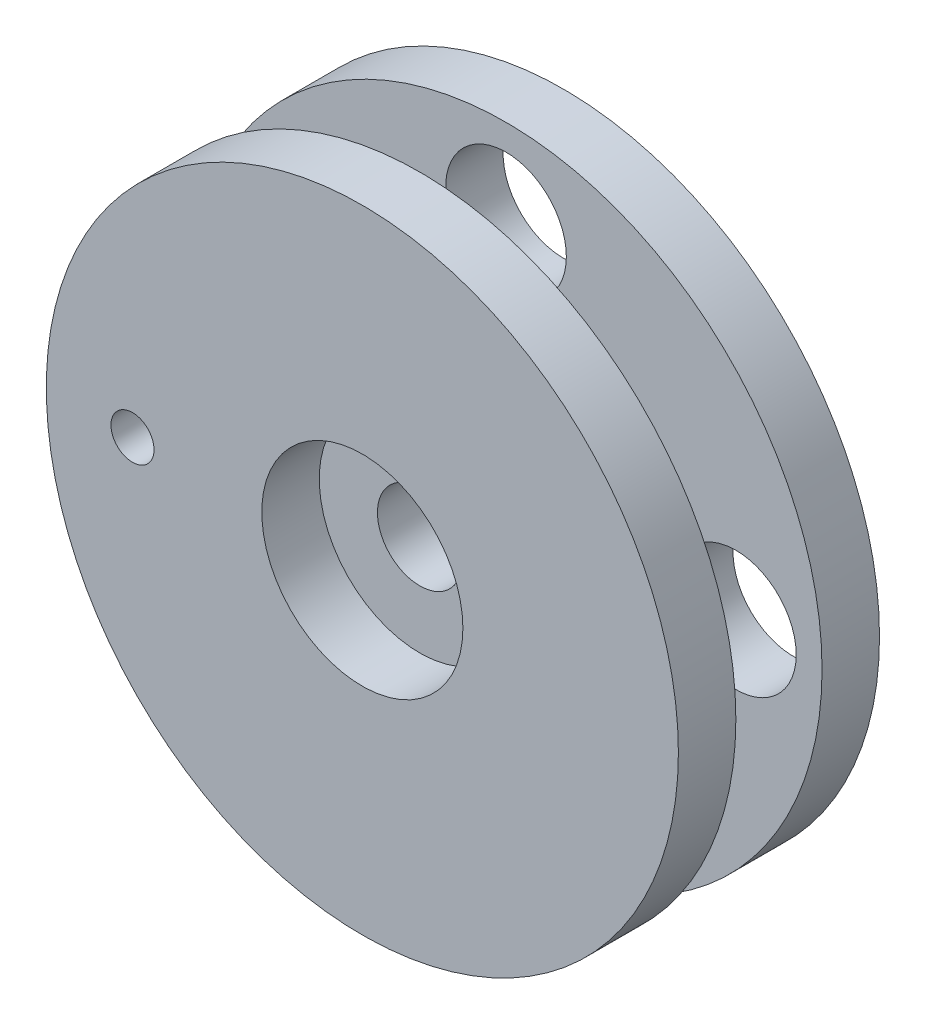
ISO-10303-21;
HEADER;
FILE_DESCRIPTION(('STEP AP214'),'2;1');
FILE_NAME('part.step','',(''),(''),'','','');
FILE_SCHEMA(('AUTOMOTIVE_DESIGN { 1 0 10303 214 1 1 1 1 }'));
ENDSEC;
DATA;
#1=APPLICATION_CONTEXT('core data for automotive mechanical design processes');
#2=APPLICATION_PROTOCOL_DEFINITION('international standard','automotive_design',2000,#1);
#3=PRODUCT_CONTEXT('',#1,'mechanical');
#4=PRODUCT('Part','Part','',(#3));
#5=PRODUCT_RELATED_PRODUCT_CATEGORY('part','',(#4));
#6=PRODUCT_DEFINITION_FORMATION('','',#4);
#7=PRODUCT_DEFINITION_CONTEXT('part definition',#1,'design');
#8=PRODUCT_DEFINITION('design','',#6,#7);
#9=PRODUCT_DEFINITION_SHAPE('','',#8);
#10=(LENGTH_UNIT() NAMED_UNIT(*) SI_UNIT(.MILLI.,.METRE.));
#11=(NAMED_UNIT(*) PLANE_ANGLE_UNIT() SI_UNIT($,.RADIAN.));
#12=(NAMED_UNIT(*) SI_UNIT($,.STERADIAN.) SOLID_ANGLE_UNIT());
#13=UNCERTAINTY_MEASURE_WITH_UNIT(LENGTH_MEASURE(1.E-05),#10,'distance_accuracy_value','');
#14=(GEOMETRIC_REPRESENTATION_CONTEXT(3) GLOBAL_UNCERTAINTY_ASSIGNED_CONTEXT((#13)) GLOBAL_UNIT_ASSIGNED_CONTEXT((#10,
#11,#12)) REPRESENTATION_CONTEXT('',''));
#15=CARTESIAN_POINT('',(0.,0.,0.));
#16=DIRECTION('',(0.,0.,1.));
#17=DIRECTION('',(1.,0.,0.));
#18=AXIS2_PLACEMENT_3D('',#15,#16,#17);
#19=CARTESIAN_POINT('',(0.,0.,2.));
#20=DIRECTION('',(0.,0.,1.));
#21=DIRECTION('',(1.,0.,0.));
#22=AXIS2_PLACEMENT_3D('',#19,#20,#21);
#23=PLANE('',#22);
#24=CARTESIAN_POINT('',(0.,-8.,2.));
#25=DIRECTION('',(0.,0.,1.));
#26=DIRECTION('',(1.,0.,0.));
#27=AXIS2_PLACEMENT_3D('',#24,#25,#26);
#28=CIRCLE('',#27,2.1);
#29=CARTESIAN_POINT('',(2.1,-8.,2.));
#30=VERTEX_POINT('',#29);
#31=EDGE_CURVE('E66',#30,#30,#28,.T.);
#32=ORIENTED_EDGE('',*,*,#31,.F.);
#33=EDGE_LOOP('',(#32));
#34=FACE_BOUND('',#33,.T.);
#35=CARTESIAN_POINT('',(0.,8.,2.));
#36=DIRECTION('',(0.,0.,1.));
#37=DIRECTION('',(1.,0.,0.));
#38=AXIS2_PLACEMENT_3D('',#35,#36,#37);
#39=CIRCLE('',#38,2.1);
#40=CARTESIAN_POINT('',(2.1,8.,2.));
#41=VERTEX_POINT('',#40);
#42=EDGE_CURVE('E54',#41,#41,#39,.T.);
#43=ORIENTED_EDGE('',*,*,#42,.F.);
#44=EDGE_LOOP('',(#43));
#45=FACE_BOUND('',#44,.T.);
#46=CARTESIAN_POINT('',(0.,0.,2.));
#47=DIRECTION('',(0.,0.,1.));
#48=DIRECTION('',(1.,0.,0.));
#49=AXIS2_PLACEMENT_3D('',#46,#47,#48);
#50=CIRCLE('',#49,11.);
#51=CARTESIAN_POINT('',(11.,0.,2.));
#52=VERTEX_POINT('',#51);
#53=EDGE_CURVE('E37',#52,#52,#50,.T.);
#54=ORIENTED_EDGE('',*,*,#53,.T.);
#55=EDGE_LOOP('',(#54));
#56=FACE_BOUND('',#55,.T.);
#57=CARTESIAN_POINT('',(-8.,0.,2.));
#58=DIRECTION('',(0.,0.,1.));
#59=DIRECTION('',(1.,0.,0.));
#60=AXIS2_PLACEMENT_3D('',#57,#58,#59);
#61=CIRCLE('',#60,2.1);
#62=CARTESIAN_POINT('',(-5.9,0.,2.));
#63=VERTEX_POINT('',#62);
#64=EDGE_CURVE('E50',#63,#63,#61,.T.);
#65=ORIENTED_EDGE('',*,*,#64,.F.);
#66=EDGE_LOOP('',(#65));
#67=FACE_BOUND('',#66,.T.);
#68=CARTESIAN_POINT('',(8.,0.,2.));
#69=DIRECTION('',(0.,0.,1.));
#70=DIRECTION('',(1.,0.,0.));
#71=AXIS2_PLACEMENT_3D('',#68,#69,#70);
#72=CIRCLE('',#71,2.1);
#73=CARTESIAN_POINT('',(10.1,0.,2.));
#74=VERTEX_POINT('',#73);
#75=EDGE_CURVE('E60',#74,#74,#72,.T.);
#76=ORIENTED_EDGE('',*,*,#75,.F.);
#77=EDGE_LOOP('',(#76));
#78=FACE_BOUND('',#77,.T.);
#79=CARTESIAN_POINT('',(0.,0.,2.));
#80=DIRECTION('',(0.,0.,1.));
#81=DIRECTION('',(1.,0.,0.));
#82=AXIS2_PLACEMENT_3D('',#79,#80,#81);
#83=CIRCLE('',#82,5.);
#84=CARTESIAN_POINT('',(5.,0.,2.));
#85=VERTEX_POINT('',#84);
#86=EDGE_CURVE('E75',#85,#85,#83,.T.);
#87=ORIENTED_EDGE('',*,*,#86,.F.);
#88=EDGE_LOOP('',(#87));
#89=FACE_BOUND('',#88,.T.);
#90=ADVANCED_FACE('F30',(#34,#45,#56,#67,#78,#89),#23,.T.);
#91=CARTESIAN_POINT('',(0.,0.,0.));
#92=DIRECTION('',(0.,0.,1.));
#93=DIRECTION('',(1.,0.,0.));
#94=AXIS2_PLACEMENT_3D('',#91,#92,#93);
#95=PLANE('',#94);
#96=CARTESIAN_POINT('',(8.,0.,0.));
#97=DIRECTION('',(0.,0.,1.));
#98=DIRECTION('',(1.,0.,0.));
#99=AXIS2_PLACEMENT_3D('',#96,#97,#98);
#100=CIRCLE('',#99,2.1);
#101=CARTESIAN_POINT('',(10.1,0.,0.));
#102=VERTEX_POINT('',#101);
#103=EDGE_CURVE('E63',#102,#102,#100,.T.);
#104=ORIENTED_EDGE('',*,*,#103,.T.);
#105=EDGE_LOOP('',(#104));
#106=FACE_BOUND('',#105,.T.);
#107=CARTESIAN_POINT('',(-8.,0.,0.));
#108=DIRECTION('',(0.,0.,1.));
#109=DIRECTION('',(1.,0.,0.));
#110=AXIS2_PLACEMENT_3D('',#107,#108,#109);
#111=CIRCLE('',#110,2.1);
#112=CARTESIAN_POINT('',(-5.9,0.,0.));
#113=VERTEX_POINT('',#112);
#114=EDGE_CURVE('E51',#113,#113,#111,.T.);
#115=ORIENTED_EDGE('',*,*,#114,.T.);
#116=EDGE_LOOP('',(#115));
#117=FACE_BOUND('',#116,.T.);
#118=CARTESIAN_POINT('',(0.,0.,0.));
#119=DIRECTION('',(0.,0.,1.));
#120=DIRECTION('',(1.,0.,0.));
#121=AXIS2_PLACEMENT_3D('',#118,#119,#120);
#122=CIRCLE('',#121,11.);
#123=CARTESIAN_POINT('',(11.,0.,0.));
#124=VERTEX_POINT('',#123);
#125=EDGE_CURVE('E41',#124,#124,#122,.T.);
#126=ORIENTED_EDGE('',*,*,#125,.F.);
#127=EDGE_LOOP('',(#126));
#128=FACE_BOUND('',#127,.T.);
#129=CARTESIAN_POINT('',(0.,0.,0.));
#130=DIRECTION('',(0.,0.,1.));
#131=DIRECTION('',(1.,0.,0.));
#132=AXIS2_PLACEMENT_3D('',#129,#130,#131);
#133=CIRCLE('',#132,1.475);
#134=CARTESIAN_POINT('',(1.475,0.,0.));
#135=VERTEX_POINT('',#134);
#136=EDGE_CURVE('E46',#135,#135,#133,.T.);
#137=ORIENTED_EDGE('',*,*,#136,.T.);
#138=EDGE_LOOP('',(#137));
#139=FACE_BOUND('',#138,.T.);
#140=CARTESIAN_POINT('',(0.,8.,0.));
#141=DIRECTION('',(0.,0.,1.));
#142=DIRECTION('',(1.,0.,0.));
#143=AXIS2_PLACEMENT_3D('',#140,#141,#142);
#144=CIRCLE('',#143,2.1);
#145=CARTESIAN_POINT('',(2.1,8.,0.));
#146=VERTEX_POINT('',#145);
#147=EDGE_CURVE('E57',#146,#146,#144,.T.);
#148=ORIENTED_EDGE('',*,*,#147,.T.);
#149=EDGE_LOOP('',(#148));
#150=FACE_BOUND('',#149,.T.);
#151=CARTESIAN_POINT('',(0.,-8.,0.));
#152=DIRECTION('',(0.,0.,1.));
#153=DIRECTION('',(1.,0.,0.));
#154=AXIS2_PLACEMENT_3D('',#151,#152,#153);
#155=CIRCLE('',#154,2.1);
#156=CARTESIAN_POINT('',(2.1,-8.,0.));
#157=VERTEX_POINT('',#156);
#158=EDGE_CURVE('E69',#157,#157,#155,.T.);
#159=ORIENTED_EDGE('',*,*,#158,.T.);
#160=EDGE_LOOP('',(#159));
#161=FACE_BOUND('',#160,.T.);
#162=ADVANCED_FACE('F122',(#106,#117,#128,#139,#150,#161),#95,.F.);
#163=CARTESIAN_POINT('',(0.,0.,2.));
#164=DIRECTION('',(0.,0.,-1.));
#165=DIRECTION('',(-1.,0.,0.));
#166=AXIS2_PLACEMENT_3D('',#163,#164,#165);
#167=CYLINDRICAL_SURFACE('',#166,11.);
#168=ORIENTED_EDGE('',*,*,#53,.F.);
#169=EDGE_LOOP('',(#168));
#170=FACE_BOUND('',#169,.T.);
#171=ORIENTED_EDGE('',*,*,#125,.T.);
#172=EDGE_LOOP('',(#171));
#173=FACE_BOUND('',#172,.T.);
#174=ADVANCED_FACE('F32',(#170,#173),#167,.T.);
#175=CARTESIAN_POINT('',(0.,0.,2.));
#176=DIRECTION('',(0.,0.,-1.));
#177=DIRECTION('',(-1.,0.,0.));
#178=AXIS2_PLACEMENT_3D('',#175,#176,#177);
#179=CYLINDRICAL_SURFACE('',#178,1.475);
#180=ORIENTED_EDGE('',*,*,#136,.F.);
#181=EDGE_LOOP('',(#180));
#182=FACE_BOUND('',#181,.T.);
#183=CARTESIAN_POINT('',(0.,0.,5.));
#184=DIRECTION('',(0.,0.,1.));
#185=DIRECTION('',(1.,0.,0.));
#186=AXIS2_PLACEMENT_3D('',#183,#184,#185);
#187=CIRCLE('',#186,1.475);
#188=CARTESIAN_POINT('',(1.475,0.,5.));
#189=VERTEX_POINT('',#188);
#190=EDGE_CURVE('E78',#189,#189,#187,.T.);
#191=ORIENTED_EDGE('',*,*,#190,.T.);
#192=EDGE_LOOP('',(#191));
#193=FACE_BOUND('',#192,.T.);
#194=ADVANCED_FACE('F132',(#182,#193),#179,.F.);
#195=CARTESIAN_POINT('',(-8.,0.,2.));
#196=DIRECTION('',(0.,0.,-1.));
#197=DIRECTION('',(-1.,0.,0.));
#198=AXIS2_PLACEMENT_3D('',#195,#196,#197);
#199=CYLINDRICAL_SURFACE('',#198,2.1);
#200=ORIENTED_EDGE('',*,*,#64,.T.);
#201=EDGE_LOOP('',(#200));
#202=FACE_BOUND('',#201,.T.);
#203=ORIENTED_EDGE('',*,*,#114,.F.);
#204=EDGE_LOOP('',(#203));
#205=FACE_BOUND('',#204,.T.);
#206=ADVANCED_FACE('F135',(#202,#205),#199,.F.);
#207=CARTESIAN_POINT('',(0.,8.,2.));
#208=DIRECTION('',(0.,0.,-1.));
#209=DIRECTION('',(-1.,0.,0.));
#210=AXIS2_PLACEMENT_3D('',#207,#208,#209);
#211=CYLINDRICAL_SURFACE('',#210,2.1);
#212=ORIENTED_EDGE('',*,*,#42,.T.);
#213=EDGE_LOOP('',(#212));
#214=FACE_BOUND('',#213,.T.);
#215=ORIENTED_EDGE('',*,*,#147,.F.);
#216=EDGE_LOOP('',(#215));
#217=FACE_BOUND('',#216,.T.);
#218=ADVANCED_FACE('F139',(#214,#217),#211,.F.);
#219=CARTESIAN_POINT('',(8.,0.,2.));
#220=DIRECTION('',(0.,0.,-1.));
#221=DIRECTION('',(-1.,0.,0.));
#222=AXIS2_PLACEMENT_3D('',#219,#220,#221);
#223=CYLINDRICAL_SURFACE('',#222,2.1);
#224=ORIENTED_EDGE('',*,*,#75,.T.);
#225=EDGE_LOOP('',(#224));
#226=FACE_BOUND('',#225,.T.);
#227=ORIENTED_EDGE('',*,*,#103,.F.);
#228=EDGE_LOOP('',(#227));
#229=FACE_BOUND('',#228,.T.);
#230=ADVANCED_FACE('F143',(#226,#229),#223,.F.);
#231=CARTESIAN_POINT('',(0.,-8.,2.));
#232=DIRECTION('',(0.,0.,-1.));
#233=DIRECTION('',(-1.,0.,0.));
#234=AXIS2_PLACEMENT_3D('',#231,#232,#233);
#235=CYLINDRICAL_SURFACE('',#234,2.1);
#236=ORIENTED_EDGE('',*,*,#31,.T.);
#237=EDGE_LOOP('',(#236));
#238=FACE_BOUND('',#237,.T.);
#239=ORIENTED_EDGE('',*,*,#158,.F.);
#240=EDGE_LOOP('',(#239));
#241=FACE_BOUND('',#240,.T.);
#242=ADVANCED_FACE('F147',(#238,#241),#235,.F.);
#243=CARTESIAN_POINT('',(0.,0.,5.));
#244=DIRECTION('',(0.,0.,1.));
#245=DIRECTION('',(1.,0.,0.));
#246=AXIS2_PLACEMENT_3D('',#243,#244,#245);
#247=PLANE('',#246);
#248=CARTESIAN_POINT('',(0.,0.,5.));
#249=DIRECTION('',(0.,0.,1.));
#250=DIRECTION('',(1.,0.,0.));
#251=AXIS2_PLACEMENT_3D('',#248,#249,#250);
#252=CIRCLE('',#251,3.5);
#253=CARTESIAN_POINT('',(3.5,0.,5.));
#254=VERTEX_POINT('',#253);
#255=EDGE_CURVE('E10',#254,#254,#252,.F.);
#256=ORIENTED_EDGE('',*,*,#255,.F.);
#257=EDGE_LOOP('',(#256));
#258=FACE_BOUND('',#257,.T.);
#259=ORIENTED_EDGE('',*,*,#190,.F.);
#260=EDGE_LOOP('',(#259));
#261=FACE_BOUND('',#260,.T.);
#262=ADVANCED_FACE('F151',(#258,#261),#247,.T.);
#263=CARTESIAN_POINT('',(0.,0.,5.));
#264=DIRECTION('',(0.,0.,-1.));
#265=DIRECTION('',(-1.,0.,0.));
#266=AXIS2_PLACEMENT_3D('',#263,#264,#265);
#267=CYLINDRICAL_SURFACE('',#266,5.);
#268=CARTESIAN_POINT('',(0.,0.,5.));
#269=DIRECTION('',(0.,0.,1.));
#270=DIRECTION('',(1.,0.,0.));
#271=AXIS2_PLACEMENT_3D('',#268,#269,#270);
#272=CIRCLE('',#271,5.);
#273=CARTESIAN_POINT('',(5.,0.,5.));
#274=VERTEX_POINT('',#273);
#275=EDGE_CURVE('E72',#274,#274,#272,.T.);
#276=ORIENTED_EDGE('',*,*,#275,.F.);
#277=EDGE_LOOP('',(#276));
#278=FACE_BOUND('',#277,.T.);
#279=ORIENTED_EDGE('',*,*,#86,.T.);
#280=EDGE_LOOP('',(#279));
#281=FACE_BOUND('',#280,.T.);
#282=ADVANCED_FACE('F115',(#278,#281),#267,.T.);
#283=CARTESIAN_POINT('',(0.,0.,5.));
#284=DIRECTION('',(0.,0.,1.));
#285=DIRECTION('',(1.,0.,0.));
#286=AXIS2_PLACEMENT_3D('',#283,#284,#285);
#287=PLANE('',#286);
#288=CARTESIAN_POINT('',(-8.,0.,5.));
#289=DIRECTION('',(0.,0.,1.));
#290=DIRECTION('',(1.,0.,0.));
#291=AXIS2_PLACEMENT_3D('',#288,#289,#290);
#292=CIRCLE('',#291,0.75);
#293=CARTESIAN_POINT('',(-7.25,0.,5.));
#294=VERTEX_POINT('',#293);
#295=EDGE_CURVE('E93',#294,#294,#292,.T.);
#296=ORIENTED_EDGE('',*,*,#295,.T.);
#297=EDGE_LOOP('',(#296));
#298=FACE_BOUND('',#297,.T.);
#299=CARTESIAN_POINT('',(0.,0.,5.));
#300=DIRECTION('',(0.,0.,1.));
#301=DIRECTION('',(1.,0.,0.));
#302=AXIS2_PLACEMENT_3D('',#299,#300,#301);
#303=CIRCLE('',#302,11.);
#304=CARTESIAN_POINT('',(11.,0.,5.));
#305=VERTEX_POINT('',#304);
#306=EDGE_CURVE('E84',#305,#305,#303,.T.);
#307=ORIENTED_EDGE('',*,*,#306,.F.);
#308=EDGE_LOOP('',(#307));
#309=FACE_BOUND('',#308,.T.);
#310=ORIENTED_EDGE('',*,*,#275,.T.);
#311=EDGE_LOOP('',(#310));
#312=FACE_BOUND('',#311,.T.);
#313=ADVANCED_FACE('F105',(#298,#309,#312),#287,.F.);
#314=CARTESIAN_POINT('',(0.,0.,7.));
#315=DIRECTION('',(0.,0.,1.));
#316=DIRECTION('',(1.,0.,0.));
#317=AXIS2_PLACEMENT_3D('',#314,#315,#316);
#318=PLANE('',#317);
#319=CARTESIAN_POINT('',(0.,0.,7.));
#320=DIRECTION('',(0.,0.,1.));
#321=DIRECTION('',(1.,0.,0.));
#322=AXIS2_PLACEMENT_3D('',#319,#320,#321);
#323=CIRCLE('',#322,3.5);
#324=CARTESIAN_POINT('',(3.5,0.,7.));
#325=VERTEX_POINT('',#324);
#326=EDGE_CURVE('E87',#325,#325,#323,.T.);
#327=ORIENTED_EDGE('',*,*,#326,.F.);
#328=EDGE_LOOP('',(#327));
#329=FACE_BOUND('',#328,.T.);
#330=CARTESIAN_POINT('',(0.,0.,7.));
#331=DIRECTION('',(0.,0.,1.));
#332=DIRECTION('',(1.,0.,0.));
#333=AXIS2_PLACEMENT_3D('',#330,#331,#332);
#334=CIRCLE('',#333,11.);
#335=CARTESIAN_POINT('',(11.,0.,7.));
#336=VERTEX_POINT('',#335);
#337=EDGE_CURVE('E83',#336,#336,#334,.T.);
#338=ORIENTED_EDGE('',*,*,#337,.T.);
#339=EDGE_LOOP('',(#338));
#340=FACE_BOUND('',#339,.T.);
#341=CARTESIAN_POINT('',(-8.,0.,7.));
#342=DIRECTION('',(0.,0.,1.));
#343=DIRECTION('',(1.,0.,0.));
#344=AXIS2_PLACEMENT_3D('',#341,#342,#343);
#345=CIRCLE('',#344,0.75);
#346=CARTESIAN_POINT('',(-7.25,0.,7.));
#347=VERTEX_POINT('',#346);
#348=EDGE_CURVE('E92',#347,#347,#345,.T.);
#349=ORIENTED_EDGE('',*,*,#348,.F.);
#350=EDGE_LOOP('',(#349));
#351=FACE_BOUND('',#350,.T.);
#352=ADVANCED_FACE('F102',(#329,#340,#351),#318,.T.);
#353=CARTESIAN_POINT('',(0.,0.,7.));
#354=DIRECTION('',(0.,0.,-1.));
#355=DIRECTION('',(-1.,0.,0.));
#356=AXIS2_PLACEMENT_3D('',#353,#354,#355);
#357=CYLINDRICAL_SURFACE('',#356,11.);
#358=ORIENTED_EDGE('',*,*,#337,.F.);
#359=EDGE_LOOP('',(#358));
#360=FACE_BOUND('',#359,.T.);
#361=ORIENTED_EDGE('',*,*,#306,.T.);
#362=EDGE_LOOP('',(#361));
#363=FACE_BOUND('',#362,.T.);
#364=ADVANCED_FACE('F104',(#360,#363),#357,.T.);
#365=CARTESIAN_POINT('',(0.,0.,7.));
#366=DIRECTION('',(0.,0.,-1.));
#367=DIRECTION('',(-1.,0.,0.));
#368=AXIS2_PLACEMENT_3D('',#365,#366,#367);
#369=CYLINDRICAL_SURFACE('',#368,3.5);
#370=ORIENTED_EDGE('',*,*,#326,.T.);
#371=EDGE_LOOP('',(#370));
#372=FACE_BOUND('',#371,.T.);
#373=ORIENTED_EDGE('',*,*,#255,.T.);
#374=EDGE_LOOP('',(#373));
#375=FACE_BOUND('',#374,.T.);
#376=ADVANCED_FACE('F112',(#372,#375),#369,.F.);
#377=CARTESIAN_POINT('',(-8.,0.,7.));
#378=DIRECTION('',(0.,0.,-1.));
#379=DIRECTION('',(-1.,0.,0.));
#380=AXIS2_PLACEMENT_3D('',#377,#378,#379);
#381=CYLINDRICAL_SURFACE('',#380,0.75);
#382=ORIENTED_EDGE('',*,*,#348,.T.);
#383=EDGE_LOOP('',(#382));
#384=FACE_BOUND('',#383,.T.);
#385=ORIENTED_EDGE('',*,*,#295,.F.);
#386=EDGE_LOOP('',(#385));
#387=FACE_BOUND('',#386,.T.);
#388=ADVANCED_FACE('F99',(#384,#387),#381,.F.);
#389=CLOSED_SHELL('',(#90,#162,#174,#194,#206,#218,#230,#242,#262,#282,#313,#352,#364,#376,#388));
#390=MANIFOLD_SOLID_BREP('B2',#389);
#391=ADVANCED_BREP_SHAPE_REPRESENTATION('',(#18,#390),#14);
#392=SHAPE_DEFINITION_REPRESENTATION(#9,#391);
ENDSEC;
END-ISO-10303-21;
